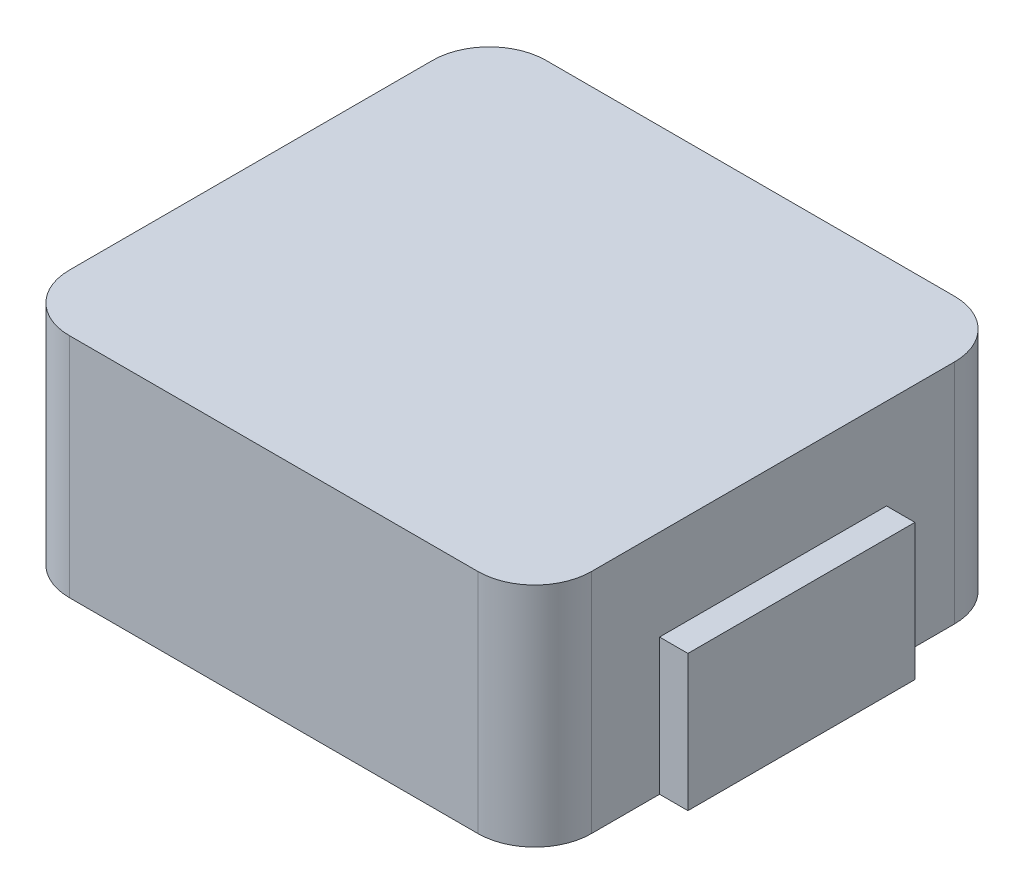
ISO-10303-21;
HEADER;
FILE_DESCRIPTION(('STEP AP214'),'2;1');
FILE_NAME('part.step','',(''),(''),'','','');
FILE_SCHEMA(('AUTOMOTIVE_DESIGN { 1 0 10303 214 1 1 1 1 }'));
ENDSEC;
DATA;
#1=APPLICATION_CONTEXT('core data for automotive mechanical design processes');
#2=APPLICATION_PROTOCOL_DEFINITION('international standard','automotive_design',2000,#1);
#3=PRODUCT_CONTEXT('',#1,'mechanical');
#4=PRODUCT('Part','Part','',(#3));
#5=PRODUCT_RELATED_PRODUCT_CATEGORY('part','',(#4));
#6=PRODUCT_DEFINITION_FORMATION('','',#4);
#7=PRODUCT_DEFINITION_CONTEXT('part definition',#1,'design');
#8=PRODUCT_DEFINITION('design','',#6,#7);
#9=PRODUCT_DEFINITION_SHAPE('','',#8);
#10=(LENGTH_UNIT() NAMED_UNIT(*) SI_UNIT(.MILLI.,.METRE.));
#11=(NAMED_UNIT(*) PLANE_ANGLE_UNIT() SI_UNIT($,.RADIAN.));
#12=(NAMED_UNIT(*) SI_UNIT($,.STERADIAN.) SOLID_ANGLE_UNIT());
#13=UNCERTAINTY_MEASURE_WITH_UNIT(LENGTH_MEASURE(1.E-05),#10,'distance_accuracy_value','');
#14=(GEOMETRIC_REPRESENTATION_CONTEXT(3) GLOBAL_UNCERTAINTY_ASSIGNED_CONTEXT((#13)) GLOBAL_UNIT_ASSIGNED_CONTEXT((#10,
#11,#12)) REPRESENTATION_CONTEXT('',''));
#15=CARTESIAN_POINT('',(0.,0.,0.));
#16=DIRECTION('',(0.,0.,1.));
#17=DIRECTION('',(1.,0.,0.));
#18=AXIS2_PLACEMENT_3D('',#15,#16,#17);
#19=CARTESIAN_POINT('',(2.3,2.,2.1));
#20=DIRECTION('',(-1.,0.,0.));
#21=DIRECTION('',(0.,0.,1.));
#22=AXIS2_PLACEMENT_3D('',#19,#20,#21);
#23=PLANE('',#22);
#24=DIRECTION('',(0.,0.,1.));
#25=VECTOR('',#24,1.);
#26=CARTESIAN_POINT('',(2.3,1.2,2.1));
#27=LINE('',#26,#25);
#28=CARTESIAN_POINT('',(2.3,1.2,-0.999999999999999));
#29=VERTEX_POINT('',#28);
#30=CARTESIAN_POINT('',(2.3,1.2,1.));
#31=VERTEX_POINT('',#30);
#32=EDGE_CURVE('E48',#29,#31,#27,.T.);
#33=ORIENTED_EDGE('',*,*,#32,.F.);
#34=DIRECTION('',(0.,-1.,0.));
#35=VECTOR('',#34,1.);
#36=CARTESIAN_POINT('',(2.3,2.,-0.999999999999999));
#37=LINE('',#36,#35);
#38=CARTESIAN_POINT('',(2.3,0.,-0.999999999999999));
#39=VERTEX_POINT('',#38);
#40=EDGE_CURVE('E226',#29,#39,#37,.T.);
#41=ORIENTED_EDGE('',*,*,#40,.T.);
#42=DIRECTION('',(0.,0.,-1.));
#43=VECTOR('',#42,1.);
#44=CARTESIAN_POINT('',(2.3,0.,2.1));
#45=LINE('',#44,#43);
#46=CARTESIAN_POINT('',(2.3,0.,-1.6));
#47=VERTEX_POINT('',#46);
#48=EDGE_CURVE('E230',#39,#47,#45,.T.);
#49=ORIENTED_EDGE('',*,*,#48,.T.);
#50=DIRECTION('',(0.,-1.,0.));
#51=VECTOR('',#50,1.);
#52=CARTESIAN_POINT('',(2.3,2.,-1.6));
#53=LINE('',#52,#51);
#54=CARTESIAN_POINT('',(2.3,2.,-1.6));
#55=VERTEX_POINT('',#54);
#56=EDGE_CURVE('E306',#47,#55,#53,.F.);
#57=ORIENTED_EDGE('',*,*,#56,.T.);
#58=DIRECTION('',(0.,0.,-1.));
#59=VECTOR('',#58,1.);
#60=CARTESIAN_POINT('',(2.3,2.,2.1));
#61=LINE('',#60,#59);
#62=CARTESIAN_POINT('',(2.3,2.,1.6));
#63=VERTEX_POINT('',#62);
#64=EDGE_CURVE('E231',#63,#55,#61,.T.);
#65=ORIENTED_EDGE('',*,*,#64,.F.);
#66=DIRECTION('',(0.,-1.,0.));
#67=VECTOR('',#66,1.);
#68=CARTESIAN_POINT('',(2.3,2.,1.6));
#69=LINE('',#68,#67);
#70=CARTESIAN_POINT('',(2.3,0.,1.6));
#71=VERTEX_POINT('',#70);
#72=EDGE_CURVE('E302',#63,#71,#69,.T.);
#73=ORIENTED_EDGE('',*,*,#72,.T.);
#74=CARTESIAN_POINT('',(2.3,0.,1.));
#75=VERTEX_POINT('',#74);
#76=EDGE_CURVE('E249',#71,#75,#45,.T.);
#77=ORIENTED_EDGE('',*,*,#76,.T.);
#78=DIRECTION('',(0.,1.,0.));
#79=VECTOR('',#78,1.);
#80=CARTESIAN_POINT('',(2.3,2.,1.));
#81=LINE('',#80,#79);
#82=EDGE_CURVE('E221',#75,#31,#81,.T.);
#83=ORIENTED_EDGE('',*,*,#82,.T.);
#84=EDGE_LOOP('',(#33,#41,#49,#57,#65,#73,#77,#83));
#85=FACE_BOUND('',#84,.T.);
#86=ADVANCED_FACE('F39',(#85),#23,.F.);
#87=CARTESIAN_POINT('',(-2.3,2.,-2.1));
#88=DIRECTION('',(0.,0.,1.));
#89=DIRECTION('',(1.,0.,0.));
#90=AXIS2_PLACEMENT_3D('',#87,#88,#89);
#91=PLANE('',#90);
#92=DIRECTION('',(-1.,0.,0.));
#93=VECTOR('',#92,1.);
#94=CARTESIAN_POINT('',(-2.3,0.,-2.1));
#95=LINE('',#94,#93);
#96=CARTESIAN_POINT('',(1.8,0.,-2.1));
#97=VERTEX_POINT('',#96);
#98=CARTESIAN_POINT('',(-1.8,0.,-2.1));
#99=VERTEX_POINT('',#98);
#100=EDGE_CURVE('E252',#97,#99,#95,.T.);
#101=ORIENTED_EDGE('',*,*,#100,.T.);
#102=DIRECTION('',(0.,-1.,0.));
#103=VECTOR('',#102,1.);
#104=CARTESIAN_POINT('',(-1.8,2.,-2.1));
#105=LINE('',#104,#103);
#106=CARTESIAN_POINT('',(-1.8,2.,-2.1));
#107=VERTEX_POINT('',#106);
#108=EDGE_CURVE('E287',#99,#107,#105,.F.);
#109=ORIENTED_EDGE('',*,*,#108,.T.);
#110=DIRECTION('',(-1.,0.,0.));
#111=VECTOR('',#110,1.);
#112=CARTESIAN_POINT('',(-2.3,2.,-2.1));
#113=LINE('',#112,#111);
#114=CARTESIAN_POINT('',(1.8,2.,-2.1));
#115=VERTEX_POINT('',#114);
#116=EDGE_CURVE('E235',#115,#107,#113,.T.);
#117=ORIENTED_EDGE('',*,*,#116,.F.);
#118=DIRECTION('',(0.,-1.,0.));
#119=VECTOR('',#118,1.);
#120=CARTESIAN_POINT('',(1.8,2.,-2.1));
#121=LINE('',#120,#119);
#122=EDGE_CURVE('E283',#115,#97,#121,.T.);
#123=ORIENTED_EDGE('',*,*,#122,.T.);
#124=EDGE_LOOP('',(#101,#109,#117,#123));
#125=FACE_BOUND('',#124,.T.);
#126=ADVANCED_FACE('F350',(#125),#91,.F.);
#127=CARTESIAN_POINT('',(-2.3,2.,2.1));
#128=DIRECTION('',(1.,0.,0.));
#129=DIRECTION('',(0.,0.,-1.));
#130=AXIS2_PLACEMENT_3D('',#127,#128,#129);
#131=PLANE('',#130);
#132=DIRECTION('',(0.,0.,-1.));
#133=VECTOR('',#132,1.);
#134=CARTESIAN_POINT('',(-2.3,1.2,2.1));
#135=LINE('',#134,#133);
#136=CARTESIAN_POINT('',(-2.3,1.2,1.));
#137=VERTEX_POINT('',#136);
#138=CARTESIAN_POINT('',(-2.3,1.2,-0.999999999999999));
#139=VERTEX_POINT('',#138);
#140=EDGE_CURVE('E11',#137,#139,#135,.T.);
#141=ORIENTED_EDGE('',*,*,#140,.F.);
#142=DIRECTION('',(0.,-1.,0.));
#143=VECTOR('',#142,1.);
#144=CARTESIAN_POINT('',(-2.3,2.,1.));
#145=LINE('',#144,#143);
#146=CARTESIAN_POINT('',(-2.3,0.,1.));
#147=VERTEX_POINT('',#146);
#148=EDGE_CURVE('E156',#137,#147,#145,.T.);
#149=ORIENTED_EDGE('',*,*,#148,.T.);
#150=DIRECTION('',(0.,0.,1.));
#151=VECTOR('',#150,1.);
#152=CARTESIAN_POINT('',(-2.3,0.,2.1));
#153=LINE('',#152,#151);
#154=CARTESIAN_POINT('',(-2.3,0.,1.6));
#155=VERTEX_POINT('',#154);
#156=EDGE_CURVE('E256',#147,#155,#153,.T.);
#157=ORIENTED_EDGE('',*,*,#156,.T.);
#158=DIRECTION('',(0.,-1.,0.));
#159=VECTOR('',#158,1.);
#160=CARTESIAN_POINT('',(-2.3,2.,1.6));
#161=LINE('',#160,#159);
#162=CARTESIAN_POINT('',(-2.3,2.,1.6));
#163=VERTEX_POINT('',#162);
#164=EDGE_CURVE('E248',#155,#163,#161,.F.);
#165=ORIENTED_EDGE('',*,*,#164,.T.);
#166=DIRECTION('',(0.,0.,1.));
#167=VECTOR('',#166,1.);
#168=CARTESIAN_POINT('',(-2.3,2.,2.1));
#169=LINE('',#168,#167);
#170=CARTESIAN_POINT('',(-2.3,2.,-1.6));
#171=VERTEX_POINT('',#170);
#172=EDGE_CURVE('E240',#171,#163,#169,.T.);
#173=ORIENTED_EDGE('',*,*,#172,.F.);
#174=DIRECTION('',(0.,-1.,0.));
#175=VECTOR('',#174,1.);
#176=CARTESIAN_POINT('',(-2.3,2.,-1.6));
#177=LINE('',#176,#175);
#178=CARTESIAN_POINT('',(-2.3,0.,-1.6));
#179=VERTEX_POINT('',#178);
#180=EDGE_CURVE('E265',#171,#179,#177,.T.);
#181=ORIENTED_EDGE('',*,*,#180,.T.);
#182=CARTESIAN_POINT('',(-2.3,0.,-0.999999999999999));
#183=VERTEX_POINT('',#182);
#184=EDGE_CURVE('E257',#179,#183,#153,.T.);
#185=ORIENTED_EDGE('',*,*,#184,.T.);
#186=DIRECTION('',(0.,1.,0.));
#187=VECTOR('',#186,1.);
#188=CARTESIAN_POINT('',(-2.3,2.,-0.999999999999999));
#189=LINE('',#188,#187);
#190=EDGE_CURVE('E55',#183,#139,#189,.T.);
#191=ORIENTED_EDGE('',*,*,#190,.T.);
#192=EDGE_LOOP('',(#141,#149,#157,#165,#173,#181,#185,#191));
#193=FACE_BOUND('',#192,.T.);
#194=ADVANCED_FACE('F357',(#193),#131,.F.);
#195=CARTESIAN_POINT('',(-2.3,2.,2.1));
#196=DIRECTION('',(0.,0.,-1.));
#197=DIRECTION('',(-1.,0.,0.));
#198=AXIS2_PLACEMENT_3D('',#195,#196,#197);
#199=PLANE('',#198);
#200=DIRECTION('',(1.,0.,0.));
#201=VECTOR('',#200,1.);
#202=CARTESIAN_POINT('',(-2.3,0.,2.1));
#203=LINE('',#202,#201);
#204=CARTESIAN_POINT('',(-1.8,0.,2.1));
#205=VERTEX_POINT('',#204);
#206=CARTESIAN_POINT('',(1.8,0.,2.1));
#207=VERTEX_POINT('',#206);
#208=EDGE_CURVE('E236',#205,#207,#203,.T.);
#209=ORIENTED_EDGE('',*,*,#208,.T.);
#210=DIRECTION('',(0.,-1.,0.));
#211=VECTOR('',#210,1.);
#212=CARTESIAN_POINT('',(1.8,2.,2.1));
#213=LINE('',#212,#211);
#214=CARTESIAN_POINT('',(1.8,2.,2.1));
#215=VERTEX_POINT('',#214);
#216=EDGE_CURVE('E313',#207,#215,#213,.F.);
#217=ORIENTED_EDGE('',*,*,#216,.T.);
#218=DIRECTION('',(1.,0.,0.));
#219=VECTOR('',#218,1.);
#220=CARTESIAN_POINT('',(-2.3,2.,2.1));
#221=LINE('',#220,#219);
#222=CARTESIAN_POINT('',(-1.8,2.,2.1));
#223=VERTEX_POINT('',#222);
#224=EDGE_CURVE('E244',#223,#215,#221,.T.);
#225=ORIENTED_EDGE('',*,*,#224,.F.);
#226=DIRECTION('',(0.,-1.,0.));
#227=VECTOR('',#226,1.);
#228=CARTESIAN_POINT('',(-1.8,2.,2.1));
#229=LINE('',#228,#227);
#230=EDGE_CURVE('E309',#223,#205,#229,.T.);
#231=ORIENTED_EDGE('',*,*,#230,.T.);
#232=EDGE_LOOP('',(#209,#217,#225,#231));
#233=FACE_BOUND('',#232,.T.);
#234=ADVANCED_FACE('F365',(#233),#199,.F.);
#235=CARTESIAN_POINT('',(0.,2.,0.));
#236=DIRECTION('',(0.,-1.,0.));
#237=DIRECTION('',(0.,0.,-1.));
#238=AXIS2_PLACEMENT_3D('',#235,#236,#237);
#239=PLANE('',#238);
#240=ORIENTED_EDGE('',*,*,#116,.T.);
#241=CARTESIAN_POINT('',(-1.8,2.,-1.6));
#242=DIRECTION('',(0.,-1.,0.));
#243=DIRECTION('',(0.,0.,-1.));
#244=AXIS2_PLACEMENT_3D('',#241,#242,#243);
#245=CIRCLE('',#244,0.5);
#246=EDGE_CURVE('E299',#107,#171,#245,.F.);
#247=ORIENTED_EDGE('',*,*,#246,.T.);
#248=ORIENTED_EDGE('',*,*,#172,.T.);
#249=CARTESIAN_POINT('',(-1.8,2.,1.6));
#250=DIRECTION('',(0.,-1.,0.));
#251=DIRECTION('',(0.,0.,-1.));
#252=AXIS2_PLACEMENT_3D('',#249,#250,#251);
#253=CIRCLE('',#252,0.5);
#254=EDGE_CURVE('E290',#163,#223,#253,.F.);
#255=ORIENTED_EDGE('',*,*,#254,.T.);
#256=ORIENTED_EDGE('',*,*,#224,.T.);
#257=CARTESIAN_POINT('',(1.8,2.,1.6));
#258=DIRECTION('',(0.,-1.,0.));
#259=DIRECTION('',(0.,0.,-1.));
#260=AXIS2_PLACEMENT_3D('',#257,#258,#259);
#261=CIRCLE('',#260,0.5);
#262=EDGE_CURVE('E293',#215,#63,#261,.F.);
#263=ORIENTED_EDGE('',*,*,#262,.T.);
#264=ORIENTED_EDGE('',*,*,#64,.T.);
#265=CARTESIAN_POINT('',(1.8,2.,-1.6));
#266=DIRECTION('',(0.,-1.,0.));
#267=DIRECTION('',(0.,0.,-1.));
#268=AXIS2_PLACEMENT_3D('',#265,#266,#267);
#269=CIRCLE('',#268,0.5);
#270=EDGE_CURVE('E296',#55,#115,#269,.F.);
#271=ORIENTED_EDGE('',*,*,#270,.T.);
#272=EDGE_LOOP('',(#240,#247,#248,#255,#256,#263,#264,#271));
#273=FACE_BOUND('',#272,.T.);
#274=ADVANCED_FACE('F347',(#273),#239,.F.);
#275=CARTESIAN_POINT('',(0.,0.,0.));
#276=DIRECTION('',(0.,-1.,0.));
#277=DIRECTION('',(0.,0.,-1.));
#278=AXIS2_PLACEMENT_3D('',#275,#276,#277);
#279=PLANE('',#278);
#280=ORIENTED_EDGE('',*,*,#156,.F.);
#281=DIRECTION('',(-1.,0.,0.));
#282=VECTOR('',#281,1.);
#283=CARTESIAN_POINT('',(-2.05,0.,1.));
#284=LINE('',#283,#282);
#285=CARTESIAN_POINT('',(-2.55,0.,1.));
#286=VERTEX_POINT('',#285);
#287=EDGE_CURVE('E180',#147,#286,#284,.T.);
#288=ORIENTED_EDGE('',*,*,#287,.T.);
#289=DIRECTION('',(0.,0.,-1.));
#290=VECTOR('',#289,1.);
#291=CARTESIAN_POINT('',(-2.55,0.,1.));
#292=LINE('',#291,#290);
#293=CARTESIAN_POINT('',(-2.55,0.,-0.999999999999999));
#294=VERTEX_POINT('',#293);
#295=EDGE_CURVE('E167',#286,#294,#292,.T.);
#296=ORIENTED_EDGE('',*,*,#295,.T.);
#297=DIRECTION('',(1.,0.,0.));
#298=VECTOR('',#297,1.);
#299=CARTESIAN_POINT('',(-2.05,0.,-0.999999999999999));
#300=LINE('',#299,#298);
#301=EDGE_CURVE('E161',#294,#183,#300,.T.);
#302=ORIENTED_EDGE('',*,*,#301,.T.);
#303=ORIENTED_EDGE('',*,*,#184,.F.);
#304=CARTESIAN_POINT('',(-1.8,0.,-1.6));
#305=DIRECTION('',(0.,-1.,0.));
#306=DIRECTION('',(0.,0.,-1.));
#307=AXIS2_PLACEMENT_3D('',#304,#305,#306);
#308=CIRCLE('',#307,0.5);
#309=EDGE_CURVE('E280',#179,#99,#308,.T.);
#310=ORIENTED_EDGE('',*,*,#309,.T.);
#311=ORIENTED_EDGE('',*,*,#100,.F.);
#312=CARTESIAN_POINT('',(1.8,0.,-1.6));
#313=DIRECTION('',(0.,-1.,0.));
#314=DIRECTION('',(0.,0.,-1.));
#315=AXIS2_PLACEMENT_3D('',#312,#313,#314);
#316=CIRCLE('',#315,0.5);
#317=EDGE_CURVE('E276',#97,#47,#316,.T.);
#318=ORIENTED_EDGE('',*,*,#317,.T.);
#319=ORIENTED_EDGE('',*,*,#48,.F.);
#320=DIRECTION('',(1.,0.,0.));
#321=VECTOR('',#320,1.);
#322=CARTESIAN_POINT('',(2.05,0.,-0.999999999999999));
#323=LINE('',#322,#321);
#324=CARTESIAN_POINT('',(2.55,0.,-0.999999999999999));
#325=VERTEX_POINT('',#324);
#326=EDGE_CURVE('E200',#39,#325,#323,.T.);
#327=ORIENTED_EDGE('',*,*,#326,.T.);
#328=DIRECTION('',(0.,0.,1.));
#329=VECTOR('',#328,1.);
#330=CARTESIAN_POINT('',(2.55,0.,1.));
#331=LINE('',#330,#329);
#332=CARTESIAN_POINT('',(2.55,0.,1.));
#333=VERTEX_POINT('',#332);
#334=EDGE_CURVE('E194',#325,#333,#331,.T.);
#335=ORIENTED_EDGE('',*,*,#334,.T.);
#336=DIRECTION('',(-1.,0.,0.));
#337=VECTOR('',#336,1.);
#338=CARTESIAN_POINT('',(2.05,0.,1.));
#339=LINE('',#338,#337);
#340=EDGE_CURVE('E211',#333,#75,#339,.T.);
#341=ORIENTED_EDGE('',*,*,#340,.T.);
#342=ORIENTED_EDGE('',*,*,#76,.F.);
#343=CARTESIAN_POINT('',(1.8,0.,1.6));
#344=DIRECTION('',(0.,-1.,0.));
#345=DIRECTION('',(0.,0.,-1.));
#346=AXIS2_PLACEMENT_3D('',#343,#344,#345);
#347=CIRCLE('',#346,0.5);
#348=EDGE_CURVE('E273',#71,#207,#347,.T.);
#349=ORIENTED_EDGE('',*,*,#348,.T.);
#350=ORIENTED_EDGE('',*,*,#208,.F.);
#351=CARTESIAN_POINT('',(-1.8,0.,1.6));
#352=DIRECTION('',(0.,-1.,0.));
#353=DIRECTION('',(0.,0.,-1.));
#354=AXIS2_PLACEMENT_3D('',#351,#352,#353);
#355=CIRCLE('',#354,0.5);
#356=EDGE_CURVE('E269',#205,#155,#355,.T.);
#357=ORIENTED_EDGE('',*,*,#356,.T.);
#358=EDGE_LOOP('',(#280,#288,#296,#302,#303,#310,#311,#318,#319,#327,#335,#341,#342,#349,#350,#357));
#359=FACE_BOUND('',#358,.T.);
#360=ADVANCED_FACE('F340',(#359),#279,.T.);
#361=CARTESIAN_POINT('',(-1.8,2.,-1.6));
#362=DIRECTION('',(0.,-1.,0.));
#363=DIRECTION('',(0.,0.,-1.));
#364=AXIS2_PLACEMENT_3D('',#361,#362,#363);
#365=CYLINDRICAL_SURFACE('',#364,0.5);
#366=ORIENTED_EDGE('',*,*,#246,.F.);
#367=ORIENTED_EDGE('',*,*,#108,.F.);
#368=ORIENTED_EDGE('',*,*,#309,.F.);
#369=ORIENTED_EDGE('',*,*,#180,.F.);
#370=EDGE_LOOP('',(#366,#367,#368,#369));
#371=FACE_BOUND('',#370,.T.);
#372=ADVANCED_FACE('F353',(#371),#365,.T.);
#373=CARTESIAN_POINT('',(1.8,2.,-1.6));
#374=DIRECTION('',(0.,-1.,0.));
#375=DIRECTION('',(0.,0.,-1.));
#376=AXIS2_PLACEMENT_3D('',#373,#374,#375);
#377=CYLINDRICAL_SURFACE('',#376,0.5);
#378=ORIENTED_EDGE('',*,*,#270,.F.);
#379=ORIENTED_EDGE('',*,*,#56,.F.);
#380=ORIENTED_EDGE('',*,*,#317,.F.);
#381=ORIENTED_EDGE('',*,*,#122,.F.);
#382=EDGE_LOOP('',(#378,#379,#380,#381));
#383=FACE_BOUND('',#382,.T.);
#384=ADVANCED_FACE('F344',(#383),#377,.T.);
#385=CARTESIAN_POINT('',(1.8,2.,1.6));
#386=DIRECTION('',(0.,-1.,0.));
#387=DIRECTION('',(0.,0.,-1.));
#388=AXIS2_PLACEMENT_3D('',#385,#386,#387);
#389=CYLINDRICAL_SURFACE('',#388,0.5);
#390=ORIENTED_EDGE('',*,*,#262,.F.);
#391=ORIENTED_EDGE('',*,*,#216,.F.);
#392=ORIENTED_EDGE('',*,*,#348,.F.);
#393=ORIENTED_EDGE('',*,*,#72,.F.);
#394=EDGE_LOOP('',(#390,#391,#392,#393));
#395=FACE_BOUND('',#394,.T.);
#396=ADVANCED_FACE('F369',(#395),#389,.T.);
#397=CARTESIAN_POINT('',(-1.8,2.,1.6));
#398=DIRECTION('',(0.,-1.,0.));
#399=DIRECTION('',(0.,0.,-1.));
#400=AXIS2_PLACEMENT_3D('',#397,#398,#399);
#401=CYLINDRICAL_SURFACE('',#400,0.5);
#402=ORIENTED_EDGE('',*,*,#254,.F.);
#403=ORIENTED_EDGE('',*,*,#164,.F.);
#404=ORIENTED_EDGE('',*,*,#356,.F.);
#405=ORIENTED_EDGE('',*,*,#230,.F.);
#406=EDGE_LOOP('',(#402,#403,#404,#405));
#407=FACE_BOUND('',#406,.T.);
#408=ADVANCED_FACE('F41',(#407),#401,.T.);
#409=CARTESIAN_POINT('',(0.,1.2,0.));
#410=DIRECTION('',(0.,-1.,0.));
#411=DIRECTION('',(0.,0.,-1.));
#412=AXIS2_PLACEMENT_3D('',#409,#410,#411);
#413=PLANE('',#412);
#414=DIRECTION('',(1.,0.,0.));
#415=VECTOR('',#414,1.);
#416=CARTESIAN_POINT('',(2.05,1.2,-0.999999999999999));
#417=LINE('',#416,#415);
#418=CARTESIAN_POINT('',(2.55,1.2,-0.999999999999999));
#419=VERTEX_POINT('',#418);
#420=EDGE_CURVE('E204',#29,#419,#417,.T.);
#421=ORIENTED_EDGE('',*,*,#420,.F.);
#422=ORIENTED_EDGE('',*,*,#32,.T.);
#423=DIRECTION('',(-1.,0.,0.));
#424=VECTOR('',#423,1.);
#425=CARTESIAN_POINT('',(2.05,1.2,1.));
#426=LINE('',#425,#424);
#427=CARTESIAN_POINT('',(2.55,1.2,1.));
#428=VERTEX_POINT('',#427);
#429=EDGE_CURVE('E199',#428,#31,#426,.T.);
#430=ORIENTED_EDGE('',*,*,#429,.F.);
#431=DIRECTION('',(0.,0.,1.));
#432=VECTOR('',#431,1.);
#433=CARTESIAN_POINT('',(2.55,1.2,1.));
#434=LINE('',#433,#432);
#435=EDGE_CURVE('E195',#419,#428,#434,.T.);
#436=ORIENTED_EDGE('',*,*,#435,.F.);
#437=EDGE_LOOP('',(#421,#422,#430,#436));
#438=FACE_BOUND('',#437,.T.);
#439=ADVANCED_FACE('F320',(#438),#413,.F.);
#440=CARTESIAN_POINT('',(2.05,1.2,-0.999999999999999));
#441=DIRECTION('',(0.,0.,-1.));
#442=DIRECTION('',(-1.,0.,0.));
#443=AXIS2_PLACEMENT_3D('',#440,#441,#442);
#444=PLANE('',#443);
#445=ORIENTED_EDGE('',*,*,#40,.F.);
#446=ORIENTED_EDGE('',*,*,#420,.T.);
#447=DIRECTION('',(0.,-1.,0.));
#448=VECTOR('',#447,1.);
#449=CARTESIAN_POINT('',(2.55,1.2,-0.999999999999999));
#450=LINE('',#449,#448);
#451=EDGE_CURVE('E217',#419,#325,#450,.T.);
#452=ORIENTED_EDGE('',*,*,#451,.T.);
#453=ORIENTED_EDGE('',*,*,#326,.F.);
#454=EDGE_LOOP('',(#445,#446,#452,#453));
#455=FACE_BOUND('',#454,.T.);
#456=ADVANCED_FACE('F334',(#455),#444,.T.);
#457=CARTESIAN_POINT('',(2.05,1.2,1.));
#458=DIRECTION('',(0.,0.,1.));
#459=DIRECTION('',(1.,0.,0.));
#460=AXIS2_PLACEMENT_3D('',#457,#458,#459);
#461=PLANE('',#460);
#462=ORIENTED_EDGE('',*,*,#82,.F.);
#463=ORIENTED_EDGE('',*,*,#340,.F.);
#464=DIRECTION('',(0.,-1.,0.));
#465=VECTOR('',#464,1.);
#466=CARTESIAN_POINT('',(2.55,1.2,1.));
#467=LINE('',#466,#465);
#468=EDGE_CURVE('E207',#428,#333,#467,.T.);
#469=ORIENTED_EDGE('',*,*,#468,.F.);
#470=ORIENTED_EDGE('',*,*,#429,.T.);
#471=EDGE_LOOP('',(#462,#463,#469,#470));
#472=FACE_BOUND('',#471,.T.);
#473=ADVANCED_FACE('F326',(#472),#461,.T.);
#474=CARTESIAN_POINT('',(2.55,1.2,1.));
#475=DIRECTION('',(1.,0.,0.));
#476=DIRECTION('',(0.,0.,-1.));
#477=AXIS2_PLACEMENT_3D('',#474,#475,#476);
#478=PLANE('',#477);
#479=ORIENTED_EDGE('',*,*,#334,.F.);
#480=ORIENTED_EDGE('',*,*,#451,.F.);
#481=ORIENTED_EDGE('',*,*,#435,.T.);
#482=ORIENTED_EDGE('',*,*,#468,.T.);
#483=EDGE_LOOP('',(#479,#480,#481,#482));
#484=FACE_BOUND('',#483,.T.);
#485=ADVANCED_FACE('F330',(#484),#478,.T.);
#486=CARTESIAN_POINT('',(0.,1.2,0.));
#487=DIRECTION('',(0.,-1.,0.));
#488=DIRECTION('',(0.,0.,-1.));
#489=AXIS2_PLACEMENT_3D('',#486,#487,#488);
#490=PLANE('',#489);
#491=DIRECTION('',(-1.,0.,0.));
#492=VECTOR('',#491,1.);
#493=CARTESIAN_POINT('',(-2.05,1.2,1.));
#494=LINE('',#493,#492);
#495=CARTESIAN_POINT('',(-2.55,1.2,1.));
#496=VERTEX_POINT('',#495);
#497=EDGE_CURVE('E150',#137,#496,#494,.T.);
#498=ORIENTED_EDGE('',*,*,#497,.F.);
#499=ORIENTED_EDGE('',*,*,#140,.T.);
#500=DIRECTION('',(1.,0.,0.));
#501=VECTOR('',#500,1.);
#502=CARTESIAN_POINT('',(-2.05,1.2,-0.999999999999999));
#503=LINE('',#502,#501);
#504=CARTESIAN_POINT('',(-2.55,1.2,-0.999999999999999));
#505=VERTEX_POINT('',#504);
#506=EDGE_CURVE('E170',#505,#139,#503,.T.);
#507=ORIENTED_EDGE('',*,*,#506,.F.);
#508=DIRECTION('',(0.,0.,-1.));
#509=VECTOR('',#508,1.);
#510=CARTESIAN_POINT('',(-2.55,1.2,1.));
#511=LINE('',#510,#509);
#512=EDGE_CURVE('E160',#496,#505,#511,.T.);
#513=ORIENTED_EDGE('',*,*,#512,.F.);
#514=EDGE_LOOP('',(#498,#499,#507,#513));
#515=FACE_BOUND('',#514,.T.);
#516=ADVANCED_FACE('F173',(#515),#490,.F.);
#517=CARTESIAN_POINT('',(-2.05,1.2,1.));
#518=DIRECTION('',(0.,0.,1.));
#519=DIRECTION('',(1.,0.,0.));
#520=AXIS2_PLACEMENT_3D('',#517,#518,#519);
#521=PLANE('',#520);
#522=ORIENTED_EDGE('',*,*,#148,.F.);
#523=ORIENTED_EDGE('',*,*,#497,.T.);
#524=DIRECTION('',(0.,-1.,0.));
#525=VECTOR('',#524,1.);
#526=CARTESIAN_POINT('',(-2.55,1.2,1.));
#527=LINE('',#526,#525);
#528=EDGE_CURVE('E154',#496,#286,#527,.T.);
#529=ORIENTED_EDGE('',*,*,#528,.T.);
#530=ORIENTED_EDGE('',*,*,#287,.F.);
#531=EDGE_LOOP('',(#522,#523,#529,#530));
#532=FACE_BOUND('',#531,.T.);
#533=ADVANCED_FACE('F152',(#532),#521,.T.);
#534=CARTESIAN_POINT('',(-2.05,1.2,-0.999999999999999));
#535=DIRECTION('',(0.,0.,-1.));
#536=DIRECTION('',(-1.,0.,0.));
#537=AXIS2_PLACEMENT_3D('',#534,#535,#536);
#538=PLANE('',#537);
#539=ORIENTED_EDGE('',*,*,#190,.F.);
#540=ORIENTED_EDGE('',*,*,#301,.F.);
#541=DIRECTION('',(0.,-1.,0.));
#542=VECTOR('',#541,1.);
#543=CARTESIAN_POINT('',(-2.55,1.2,-0.999999999999999));
#544=LINE('',#543,#542);
#545=EDGE_CURVE('E169',#505,#294,#544,.T.);
#546=ORIENTED_EDGE('',*,*,#545,.F.);
#547=ORIENTED_EDGE('',*,*,#506,.T.);
#548=EDGE_LOOP('',(#539,#540,#546,#547));
#549=FACE_BOUND('',#548,.T.);
#550=ADVANCED_FACE('F375',(#549),#538,.T.);
#551=CARTESIAN_POINT('',(-2.55,1.2,1.));
#552=DIRECTION('',(-1.,0.,0.));
#553=DIRECTION('',(0.,0.,1.));
#554=AXIS2_PLACEMENT_3D('',#551,#552,#553);
#555=PLANE('',#554);
#556=ORIENTED_EDGE('',*,*,#295,.F.);
#557=ORIENTED_EDGE('',*,*,#528,.F.);
#558=ORIENTED_EDGE('',*,*,#512,.T.);
#559=ORIENTED_EDGE('',*,*,#545,.T.);
#560=EDGE_LOOP('',(#556,#557,#558,#559));
#561=FACE_BOUND('',#560,.T.);
#562=ADVANCED_FACE('F165',(#561),#555,.T.);
#563=CLOSED_SHELL('',(#86,#126,#194,#234,#274,#360,#372,#384,#396,#408,#439,#456,#473,#485,#516,
#533,#550,#562));
#564=MANIFOLD_SOLID_BREP('B2',#563);
#565=ADVANCED_BREP_SHAPE_REPRESENTATION('',(#18,#564),#14);
#566=SHAPE_DEFINITION_REPRESENTATION(#9,#565);
ENDSEC;
END-ISO-10303-21;
